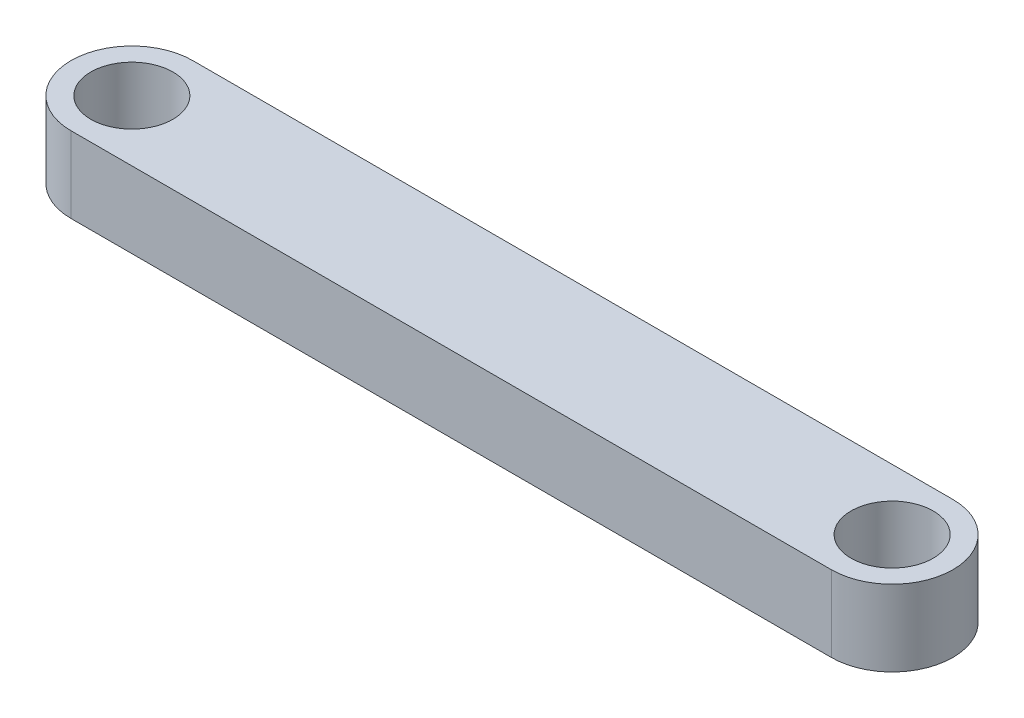
ISO-10303-21;
HEADER;
FILE_DESCRIPTION(('STEP AP214'),'2;1');
FILE_NAME('part.step','',(''),(''),'','','');
FILE_SCHEMA(('AUTOMOTIVE_DESIGN { 1 0 10303 214 1 1 1 1 }'));
ENDSEC;
DATA;
#1=APPLICATION_CONTEXT('core data for automotive mechanical design processes');
#2=APPLICATION_PROTOCOL_DEFINITION('international standard','automotive_design',2000,#1);
#3=PRODUCT_CONTEXT('',#1,'mechanical');
#4=PRODUCT('Part','Part','',(#3));
#5=PRODUCT_RELATED_PRODUCT_CATEGORY('part','',(#4));
#6=PRODUCT_DEFINITION_FORMATION('','',#4);
#7=PRODUCT_DEFINITION_CONTEXT('part definition',#1,'design');
#8=PRODUCT_DEFINITION('design','',#6,#7);
#9=PRODUCT_DEFINITION_SHAPE('','',#8);
#10=(LENGTH_UNIT() NAMED_UNIT(*) SI_UNIT(.MILLI.,.METRE.));
#11=(NAMED_UNIT(*) PLANE_ANGLE_UNIT() SI_UNIT($,.RADIAN.));
#12=(NAMED_UNIT(*) SI_UNIT($,.STERADIAN.) SOLID_ANGLE_UNIT());
#13=UNCERTAINTY_MEASURE_WITH_UNIT(LENGTH_MEASURE(1.E-05),#10,'distance_accuracy_value','');
#14=(GEOMETRIC_REPRESENTATION_CONTEXT(3) GLOBAL_UNCERTAINTY_ASSIGNED_CONTEXT((#13)) GLOBAL_UNIT_ASSIGNED_CONTEXT((#10,
#11,#12)) REPRESENTATION_CONTEXT('',''));
#15=CARTESIAN_POINT('',(0.,0.,0.));
#16=DIRECTION('',(0.,0.,1.));
#17=DIRECTION('',(1.,0.,0.));
#18=AXIS2_PLACEMENT_3D('',#15,#16,#17);
#19=CARTESIAN_POINT('',(-25.,5.,0.));
#20=DIRECTION('',(0.,1.,0.));
#21=DIRECTION('',(0.,0.,1.));
#22=AXIS2_PLACEMENT_3D('',#19,#20,#21);
#23=PLANE('',#22);
#24=CARTESIAN_POINT('',(-25.,5.,0.));
#25=DIRECTION('',(0.,1.,0.));
#26=DIRECTION('',(0.,0.,1.));
#27=AXIS2_PLACEMENT_3D('',#24,#25,#26);
#28=CIRCLE('',#27,2.7);
#29=CARTESIAN_POINT('',(-25.,5.,2.7));
#30=VERTEX_POINT('',#29);
#31=EDGE_CURVE('E116',#30,#30,#28,.T.);
#32=ORIENTED_EDGE('',*,*,#31,.F.);
#33=EDGE_LOOP('',(#32));
#34=FACE_BOUND('',#33,.T.);
#35=CARTESIAN_POINT('',(-25.,5.,0.));
#36=DIRECTION('',(0.,1.,0.));
#37=DIRECTION('',(0.,0.,1.));
#38=AXIS2_PLACEMENT_3D('',#35,#36,#37);
#39=CIRCLE('',#38,4.);
#40=CARTESIAN_POINT('',(-25.,5.,-4.));
#41=VERTEX_POINT('',#40);
#42=CARTESIAN_POINT('',(-25.,5.,4.));
#43=VERTEX_POINT('',#42);
#44=EDGE_CURVE('E96',#41,#43,#39,.T.);
#45=ORIENTED_EDGE('',*,*,#44,.T.);
#46=DIRECTION('',(1.,0.,0.));
#47=VECTOR('',#46,1.);
#48=CARTESIAN_POINT('',(-25.,5.,4.));
#49=LINE('',#48,#47);
#50=CARTESIAN_POINT('',(25.,5.,3.99999999999999));
#51=VERTEX_POINT('',#50);
#52=EDGE_CURVE('E91',#43,#51,#49,.T.);
#53=ORIENTED_EDGE('',*,*,#52,.T.);
#54=CARTESIAN_POINT('',(25.,5.,0.));
#55=DIRECTION('',(0.,1.,0.));
#56=DIRECTION('',(0.,0.,1.));
#57=AXIS2_PLACEMENT_3D('',#54,#55,#56);
#58=CIRCLE('',#57,4.);
#59=CARTESIAN_POINT('',(25.,5.,-4.00000000000001));
#60=VERTEX_POINT('',#59);
#61=EDGE_CURVE('E94',#51,#60,#58,.T.);
#62=ORIENTED_EDGE('',*,*,#61,.T.);
#63=DIRECTION('',(-1.,0.,0.));
#64=VECTOR('',#63,1.);
#65=CARTESIAN_POINT('',(-25.,5.,-4.));
#66=LINE('',#65,#64);
#67=EDGE_CURVE('E61',#60,#41,#66,.T.);
#68=ORIENTED_EDGE('',*,*,#67,.T.);
#69=EDGE_LOOP('',(#45,#53,#62,#68));
#70=FACE_BOUND('',#69,.T.);
#71=CARTESIAN_POINT('',(25.,5.,0.));
#72=DIRECTION('',(0.,1.,0.));
#73=DIRECTION('',(0.,0.,1.));
#74=AXIS2_PLACEMENT_3D('',#71,#72,#73);
#75=CIRCLE('',#74,2.7);
#76=CARTESIAN_POINT('',(25.,5.,2.69999999999999));
#77=VERTEX_POINT('',#76);
#78=EDGE_CURVE('E138',#77,#77,#75,.T.);
#79=ORIENTED_EDGE('',*,*,#78,.F.);
#80=EDGE_LOOP('',(#79));
#81=FACE_BOUND('',#80,.T.);
#82=ADVANCED_FACE('F43',(#34,#70,#81),#23,.T.);
#83=CARTESIAN_POINT('',(-25.,0.,0.));
#84=DIRECTION('',(0.,1.,0.));
#85=DIRECTION('',(0.,0.,1.));
#86=AXIS2_PLACEMENT_3D('',#83,#84,#85);
#87=PLANE('',#86);
#88=CARTESIAN_POINT('',(-25.,0.,0.));
#89=DIRECTION('',(0.,1.,0.));
#90=DIRECTION('',(0.,0.,1.));
#91=AXIS2_PLACEMENT_3D('',#88,#89,#90);
#92=CIRCLE('',#91,4.);
#93=CARTESIAN_POINT('',(-25.,0.,-4.));
#94=VERTEX_POINT('',#93);
#95=CARTESIAN_POINT('',(-25.,0.,4.));
#96=VERTEX_POINT('',#95);
#97=EDGE_CURVE('E112',#94,#96,#92,.T.);
#98=ORIENTED_EDGE('',*,*,#97,.F.);
#99=DIRECTION('',(-1.,0.,0.));
#100=VECTOR('',#99,1.);
#101=CARTESIAN_POINT('',(-25.,0.,-4.));
#102=LINE('',#101,#100);
#103=CARTESIAN_POINT('',(25.,0.,-4.00000000000001));
#104=VERTEX_POINT('',#103);
#105=EDGE_CURVE('E84',#104,#94,#102,.T.);
#106=ORIENTED_EDGE('',*,*,#105,.F.);
#107=CARTESIAN_POINT('',(25.,0.,0.));
#108=DIRECTION('',(0.,1.,0.));
#109=DIRECTION('',(0.,0.,1.));
#110=AXIS2_PLACEMENT_3D('',#107,#108,#109);
#111=CIRCLE('',#110,4.);
#112=CARTESIAN_POINT('',(25.,0.,3.99999999999999));
#113=VERTEX_POINT('',#112);
#114=EDGE_CURVE('E78',#113,#104,#111,.T.);
#115=ORIENTED_EDGE('',*,*,#114,.F.);
#116=DIRECTION('',(1.,0.,0.));
#117=VECTOR('',#116,1.);
#118=CARTESIAN_POINT('',(-25.,0.,4.));
#119=LINE('',#118,#117);
#120=EDGE_CURVE('E101',#96,#113,#119,.T.);
#121=ORIENTED_EDGE('',*,*,#120,.F.);
#122=EDGE_LOOP('',(#98,#106,#115,#121));
#123=FACE_BOUND('',#122,.T.);
#124=CARTESIAN_POINT('',(-25.,0.,0.));
#125=DIRECTION('',(0.,1.,0.));
#126=DIRECTION('',(0.,0.,1.));
#127=AXIS2_PLACEMENT_3D('',#124,#125,#126);
#128=CIRCLE('',#127,2.7);
#129=CARTESIAN_POINT('',(-25.,0.,2.7));
#130=VERTEX_POINT('',#129);
#131=EDGE_CURVE('E134',#130,#130,#128,.T.);
#132=ORIENTED_EDGE('',*,*,#131,.T.);
#133=EDGE_LOOP('',(#132));
#134=FACE_BOUND('',#133,.T.);
#135=CARTESIAN_POINT('',(25.,0.,0.));
#136=DIRECTION('',(0.,1.,0.));
#137=DIRECTION('',(0.,0.,1.));
#138=AXIS2_PLACEMENT_3D('',#135,#136,#137);
#139=CIRCLE('',#138,2.7);
#140=CARTESIAN_POINT('',(25.,0.,2.69999999999999));
#141=VERTEX_POINT('',#140);
#142=EDGE_CURVE('E142',#141,#141,#139,.T.);
#143=ORIENTED_EDGE('',*,*,#142,.T.);
#144=EDGE_LOOP('',(#143));
#145=FACE_BOUND('',#144,.T.);
#146=ADVANCED_FACE('F129',(#123,#134,#145),#87,.F.);
#147=CARTESIAN_POINT('',(-25.,5.,0.));
#148=DIRECTION('',(0.,-1.,0.));
#149=DIRECTION('',(0.,0.,-1.));
#150=AXIS2_PLACEMENT_3D('',#147,#148,#149);
#151=CYLINDRICAL_SURFACE('',#150,4.);
#152=ORIENTED_EDGE('',*,*,#97,.T.);
#153=DIRECTION('',(0.,-1.,0.));
#154=VECTOR('',#153,1.);
#155=CARTESIAN_POINT('',(-25.,5.,4.));
#156=LINE('',#155,#154);
#157=EDGE_CURVE('E11',#43,#96,#156,.T.);
#158=ORIENTED_EDGE('',*,*,#157,.F.);
#159=ORIENTED_EDGE('',*,*,#44,.F.);
#160=DIRECTION('',(0.,-1.,0.));
#161=VECTOR('',#160,1.);
#162=CARTESIAN_POINT('',(-25.,5.,-4.));
#163=LINE('',#162,#161);
#164=EDGE_CURVE('E108',#41,#94,#163,.T.);
#165=ORIENTED_EDGE('',*,*,#164,.T.);
#166=EDGE_LOOP('',(#152,#158,#159,#165));
#167=FACE_BOUND('',#166,.T.);
#168=ADVANCED_FACE('F45',(#167),#151,.T.);
#169=CARTESIAN_POINT('',(-25.,5.,4.));
#170=DIRECTION('',(0.,0.,-1.));
#171=DIRECTION('',(-1.,0.,0.));
#172=AXIS2_PLACEMENT_3D('',#169,#170,#171);
#173=PLANE('',#172);
#174=ORIENTED_EDGE('',*,*,#120,.T.);
#175=DIRECTION('',(0.,-1.,0.));
#176=VECTOR('',#175,1.);
#177=CARTESIAN_POINT('',(25.,5.,3.99999999999999));
#178=LINE('',#177,#176);
#179=EDGE_CURVE('E53',#51,#113,#178,.T.);
#180=ORIENTED_EDGE('',*,*,#179,.F.);
#181=ORIENTED_EDGE('',*,*,#52,.F.);
#182=ORIENTED_EDGE('',*,*,#157,.T.);
#183=EDGE_LOOP('',(#174,#180,#181,#182));
#184=FACE_BOUND('',#183,.T.);
#185=ADVANCED_FACE('F100',(#184),#173,.F.);
#186=CARTESIAN_POINT('',(25.,5.,0.));
#187=DIRECTION('',(0.,-1.,0.));
#188=DIRECTION('',(0.,0.,-1.));
#189=AXIS2_PLACEMENT_3D('',#186,#187,#188);
#190=CYLINDRICAL_SURFACE('',#189,4.);
#191=ORIENTED_EDGE('',*,*,#114,.T.);
#192=DIRECTION('',(0.,-1.,0.));
#193=VECTOR('',#192,1.);
#194=CARTESIAN_POINT('',(25.,5.,-4.00000000000001));
#195=LINE('',#194,#193);
#196=EDGE_CURVE('E103',#60,#104,#195,.T.);
#197=ORIENTED_EDGE('',*,*,#196,.F.);
#198=ORIENTED_EDGE('',*,*,#61,.F.);
#199=ORIENTED_EDGE('',*,*,#179,.T.);
#200=EDGE_LOOP('',(#191,#197,#198,#199));
#201=FACE_BOUND('',#200,.T.);
#202=ADVANCED_FACE('F104',(#201),#190,.T.);
#203=CARTESIAN_POINT('',(-25.,5.,-4.));
#204=DIRECTION('',(0.,0.,1.));
#205=DIRECTION('',(1.,0.,0.));
#206=AXIS2_PLACEMENT_3D('',#203,#204,#205);
#207=PLANE('',#206);
#208=ORIENTED_EDGE('',*,*,#105,.T.);
#209=ORIENTED_EDGE('',*,*,#164,.F.);
#210=ORIENTED_EDGE('',*,*,#67,.F.);
#211=ORIENTED_EDGE('',*,*,#196,.T.);
#212=EDGE_LOOP('',(#208,#209,#210,#211));
#213=FACE_BOUND('',#212,.T.);
#214=ADVANCED_FACE('F126',(#213),#207,.F.);
#215=CARTESIAN_POINT('',(-25.,5.,0.));
#216=DIRECTION('',(0.,-1.,0.));
#217=DIRECTION('',(0.,0.,-1.));
#218=AXIS2_PLACEMENT_3D('',#215,#216,#217);
#219=CYLINDRICAL_SURFACE('',#218,2.7);
#220=ORIENTED_EDGE('',*,*,#31,.T.);
#221=EDGE_LOOP('',(#220));
#222=FACE_BOUND('',#221,.T.);
#223=ORIENTED_EDGE('',*,*,#131,.F.);
#224=EDGE_LOOP('',(#223));
#225=FACE_BOUND('',#224,.T.);
#226=ADVANCED_FACE('F161',(#222,#225),#219,.F.);
#227=CARTESIAN_POINT('',(25.,5.,0.));
#228=DIRECTION('',(0.,-1.,0.));
#229=DIRECTION('',(0.,0.,-1.));
#230=AXIS2_PLACEMENT_3D('',#227,#228,#229);
#231=CYLINDRICAL_SURFACE('',#230,2.7);
#232=ORIENTED_EDGE('',*,*,#78,.T.);
#233=EDGE_LOOP('',(#232));
#234=FACE_BOUND('',#233,.T.);
#235=ORIENTED_EDGE('',*,*,#142,.F.);
#236=EDGE_LOOP('',(#235));
#237=FACE_BOUND('',#236,.T.);
#238=ADVANCED_FACE('F150',(#234,#237),#231,.F.);
#239=CLOSED_SHELL('',(#82,#146,#168,#185,#202,#214,#226,#238));
#240=MANIFOLD_SOLID_BREP('B2',#239);
#241=ADVANCED_BREP_SHAPE_REPRESENTATION('',(#18,#240),#14);
#242=SHAPE_DEFINITION_REPRESENTATION(#9,#241);
ENDSEC;
END-ISO-10303-21;
